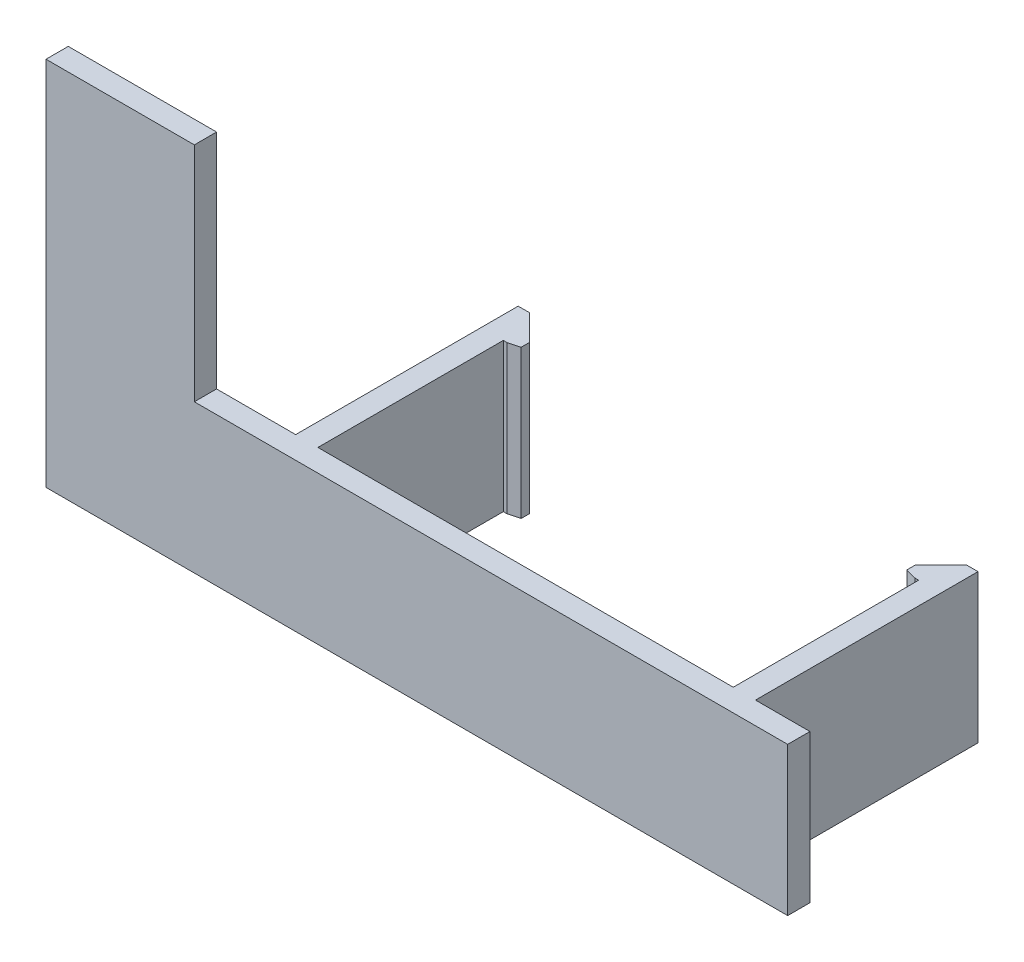
ISO-10303-21;
HEADER;
FILE_DESCRIPTION(('STEP AP214'),'2;1');
FILE_NAME('part.step','',(''),(''),'','','');
FILE_SCHEMA(('AUTOMOTIVE_DESIGN { 1 0 10303 214 1 1 1 1 }'));
ENDSEC;
DATA;
#1=APPLICATION_CONTEXT('core data for automotive mechanical design processes');
#2=APPLICATION_PROTOCOL_DEFINITION('international standard','automotive_design',2000,#1);
#3=PRODUCT_CONTEXT('',#1,'mechanical');
#4=PRODUCT('Part','Part','',(#3));
#5=PRODUCT_RELATED_PRODUCT_CATEGORY('part','',(#4));
#6=PRODUCT_DEFINITION_FORMATION('','',#4);
#7=PRODUCT_DEFINITION_CONTEXT('part definition',#1,'design');
#8=PRODUCT_DEFINITION('design','',#6,#7);
#9=PRODUCT_DEFINITION_SHAPE('','',#8);
#10=(LENGTH_UNIT() NAMED_UNIT(*) SI_UNIT(.MILLI.,.METRE.));
#11=(NAMED_UNIT(*) PLANE_ANGLE_UNIT() SI_UNIT($,.RADIAN.));
#12=(NAMED_UNIT(*) SI_UNIT($,.STERADIAN.) SOLID_ANGLE_UNIT());
#13=UNCERTAINTY_MEASURE_WITH_UNIT(LENGTH_MEASURE(1.E-05),#10,'distance_accuracy_value','');
#14=(GEOMETRIC_REPRESENTATION_CONTEXT(3) GLOBAL_UNCERTAINTY_ASSIGNED_CONTEXT((#13)) GLOBAL_UNIT_ASSIGNED_CONTEXT((#10,
#11,#12)) REPRESENTATION_CONTEXT('',''));
#15=CARTESIAN_POINT('',(0.,0.,0.));
#16=DIRECTION('',(0.,0.,1.));
#17=DIRECTION('',(1.,0.,0.));
#18=AXIS2_PLACEMENT_3D('',#15,#16,#17);
#19=CARTESIAN_POINT('',(0.,0.,0.));
#20=DIRECTION('',(0.,0.,1.));
#21=DIRECTION('',(1.,0.,0.));
#22=AXIS2_PLACEMENT_3D('',#19,#20,#21);
#23=PLANE('',#22);
#24=DIRECTION('',(-1.,0.,0.));
#25=VECTOR('',#24,1.);
#26=CARTESIAN_POINT('',(0.,-30.,0.));
#27=LINE('',#26,#25);
#28=CARTESIAN_POINT('',(-19.3380528872022,-30.,0.));
#29=VERTEX_POINT('',#28);
#30=CARTESIAN_POINT('',(-29.9999999999999,-30.,0.));
#31=VERTEX_POINT('',#30);
#32=EDGE_CURVE('E331',#29,#31,#27,.T.);
#33=ORIENTED_EDGE('',*,*,#32,.F.);
#34=DIRECTION('',(0.,-1.,0.));
#35=VECTOR('',#34,1.);
#36=CARTESIAN_POINT('',(-19.3380528872022,-50.,0.));
#37=LINE('',#36,#35);
#38=CARTESIAN_POINT('',(-19.3380528872022,-50.,0.));
#39=VERTEX_POINT('',#38);
#40=EDGE_CURVE('E212',#29,#39,#37,.T.);
#41=ORIENTED_EDGE('',*,*,#40,.T.);
#42=DIRECTION('',(1.,0.,0.));
#43=VECTOR('',#42,1.);
#44=CARTESIAN_POINT('',(0.,-50.,0.));
#45=LINE('',#44,#43);
#46=CARTESIAN_POINT('',(-50.,-50.,0.));
#47=VERTEX_POINT('',#46);
#48=EDGE_CURVE('E323',#47,#39,#45,.T.);
#49=ORIENTED_EDGE('',*,*,#48,.F.);
#50=DIRECTION('',(0.,1.,0.));
#51=VECTOR('',#50,1.);
#52=CARTESIAN_POINT('',(-50.,0.,0.));
#53=LINE('',#52,#51);
#54=CARTESIAN_POINT('',(-50.,0.,0.));
#55=VERTEX_POINT('',#54);
#56=EDGE_CURVE('E318',#47,#55,#53,.T.);
#57=ORIENTED_EDGE('',*,*,#56,.T.);
#58=DIRECTION('',(1.,0.,0.));
#59=VECTOR('',#58,1.);
#60=CARTESIAN_POINT('',(0.,0.,0.));
#61=LINE('',#60,#59);
#62=CARTESIAN_POINT('',(-30.,0.,0.));
#63=VERTEX_POINT('',#62);
#64=EDGE_CURVE('E291',#55,#63,#61,.T.);
#65=ORIENTED_EDGE('',*,*,#64,.T.);
#66=DIRECTION('',(0.,-1.,0.));
#67=VECTOR('',#66,1.);
#68=CARTESIAN_POINT('',(-30.,0.,0.));
#69=LINE('',#68,#67);
#70=EDGE_CURVE('E297',#63,#31,#69,.T.);
#71=ORIENTED_EDGE('',*,*,#70,.T.);
#72=EDGE_LOOP('',(#33,#41,#49,#57,#65,#71));
#73=FACE_BOUND('',#72,.T.);
#74=ADVANCED_FACE('F43',(#73),#23,.F.);
#75=CARTESIAN_POINT('',(39.6619471127978,-50.,-30.));
#76=DIRECTION('',(1.,0.,0.));
#77=DIRECTION('',(0.,0.,-1.));
#78=AXIS2_PLACEMENT_3D('',#75,#76,#77);
#79=PLANE('',#78);
#80=DIRECTION('',(0.,1.,0.));
#81=VECTOR('',#80,1.);
#82=CARTESIAN_POINT('',(39.6619471127978,-50.,-25.));
#83=LINE('',#82,#81);
#84=CARTESIAN_POINT('',(39.6619471127978,-50.,-25.));
#85=VERTEX_POINT('',#84);
#86=CARTESIAN_POINT('',(39.6619471127978,-30.,-25.));
#87=VERTEX_POINT('',#86);
#88=EDGE_CURVE('E214',#85,#87,#83,.T.);
#89=ORIENTED_EDGE('',*,*,#88,.F.);
#90=DIRECTION('',(0.,0.,1.));
#91=VECTOR('',#90,1.);
#92=CARTESIAN_POINT('',(39.6619471127978,-50.,-30.));
#93=LINE('',#92,#91);
#94=CARTESIAN_POINT('',(39.6619471127978,-50.,0.));
#95=VERTEX_POINT('',#94);
#96=EDGE_CURVE('E283',#85,#95,#93,.T.);
#97=ORIENTED_EDGE('',*,*,#96,.T.);
#98=DIRECTION('',(0.,1.,0.));
#99=VECTOR('',#98,1.);
#100=CARTESIAN_POINT('',(39.6619471127978,-50.,0.));
#101=LINE('',#100,#99);
#102=CARTESIAN_POINT('',(39.6619471127978,-30.,0.));
#103=VERTEX_POINT('',#102);
#104=EDGE_CURVE('E263',#95,#103,#101,.T.);
#105=ORIENTED_EDGE('',*,*,#104,.T.);
#106=DIRECTION('',(0.,0.,1.));
#107=VECTOR('',#106,1.);
#108=CARTESIAN_POINT('',(39.6619471127978,-30.,-30.));
#109=LINE('',#108,#107);
#110=EDGE_CURVE('E280',#87,#103,#109,.T.);
#111=ORIENTED_EDGE('',*,*,#110,.F.);
#112=EDGE_LOOP('',(#89,#97,#105,#111));
#113=FACE_BOUND('',#112,.T.);
#114=ADVANCED_FACE('F453',(#113),#79,.F.);
#115=DIRECTION('',(0.,-1.,0.));
#116=VECTOR('',#115,1.);
#117=CARTESIAN_POINT('',(42.6619471127978,-50.,0.));
#118=LINE('',#117,#116);
#119=CARTESIAN_POINT('',(42.6619471127978,-30.,0.));
#120=VERTEX_POINT('',#119);
#121=CARTESIAN_POINT('',(42.6619471127978,-50.,0.));
#122=VERTEX_POINT('',#121);
#123=EDGE_CURVE('E257',#120,#122,#118,.T.);
#124=ORIENTED_EDGE('',*,*,#123,.F.);
#125=CARTESIAN_POINT('',(50.,-30.,0.));
#126=VERTEX_POINT('',#125);
#127=EDGE_CURVE('E332',#126,#120,#27,.T.);
#128=ORIENTED_EDGE('',*,*,#127,.F.);
#129=DIRECTION('',(0.,1.,0.));
#130=VECTOR('',#129,1.);
#131=CARTESIAN_POINT('',(50.,0.,0.));
#132=LINE('',#131,#130);
#133=CARTESIAN_POINT('',(50.,-50.,0.));
#134=VERTEX_POINT('',#133);
#135=EDGE_CURVE('E327',#134,#126,#132,.T.);
#136=ORIENTED_EDGE('',*,*,#135,.F.);
#137=EDGE_CURVE('E322',#122,#134,#45,.T.);
#138=ORIENTED_EDGE('',*,*,#137,.F.);
#139=EDGE_LOOP('',(#124,#128,#136,#138));
#140=FACE_BOUND('',#139,.T.);
#141=ADVANCED_FACE('F422',(#140),#23,.F.);
#142=CARTESIAN_POINT('',(-16.3380528872022,-50.,0.));
#143=VERTEX_POINT('',#142);
#144=EDGE_CURVE('E328',#143,#95,#45,.T.);
#145=ORIENTED_EDGE('',*,*,#144,.F.);
#146=DIRECTION('',(0.,1.,0.));
#147=VECTOR('',#146,1.);
#148=CARTESIAN_POINT('',(-16.3380528872022,-50.,0.));
#149=LINE('',#148,#147);
#150=CARTESIAN_POINT('',(-16.3380528872022,-30.,0.));
#151=VERTEX_POINT('',#150);
#152=EDGE_CURVE('E220',#143,#151,#149,.T.);
#153=ORIENTED_EDGE('',*,*,#152,.T.);
#154=EDGE_CURVE('E336',#103,#151,#27,.T.);
#155=ORIENTED_EDGE('',*,*,#154,.F.);
#156=ORIENTED_EDGE('',*,*,#104,.F.);
#157=EDGE_LOOP('',(#145,#153,#155,#156));
#158=FACE_BOUND('',#157,.T.);
#159=ADVANCED_FACE('F459',(#158),#23,.F.);
#160=CARTESIAN_POINT('',(0.,0.,3.));
#161=DIRECTION('',(0.,1.,0.));
#162=DIRECTION('',(0.,0.,1.));
#163=AXIS2_PLACEMENT_3D('',#160,#161,#162);
#164=PLANE('',#163);
#165=ORIENTED_EDGE('',*,*,#64,.F.);
#166=DIRECTION('',(0.,0.,-1.));
#167=VECTOR('',#166,1.);
#168=CARTESIAN_POINT('',(-50.,0.,3.));
#169=LINE('',#168,#167);
#170=CARTESIAN_POINT('',(-50.,0.,3.));
#171=VERTEX_POINT('',#170);
#172=EDGE_CURVE('E357',#171,#55,#169,.T.);
#173=ORIENTED_EDGE('',*,*,#172,.F.);
#174=DIRECTION('',(1.,0.,0.));
#175=VECTOR('',#174,1.);
#176=CARTESIAN_POINT('',(0.,0.,3.));
#177=LINE('',#176,#175);
#178=CARTESIAN_POINT('',(-30.,0.,3.));
#179=VERTEX_POINT('',#178);
#180=EDGE_CURVE('E292',#171,#179,#177,.T.);
#181=ORIENTED_EDGE('',*,*,#180,.T.);
#182=DIRECTION('',(0.,0.,-1.));
#183=VECTOR('',#182,1.);
#184=CARTESIAN_POINT('',(-30.,0.,3.));
#185=LINE('',#184,#183);
#186=EDGE_CURVE('E314',#179,#63,#185,.T.);
#187=ORIENTED_EDGE('',*,*,#186,.T.);
#188=EDGE_LOOP('',(#165,#173,#181,#187));
#189=FACE_BOUND('',#188,.T.);
#190=ADVANCED_FACE('F500',(#189),#164,.T.);
#191=CARTESIAN_POINT('',(-50.,0.,3.));
#192=DIRECTION('',(-1.,0.,0.));
#193=DIRECTION('',(0.,0.,1.));
#194=AXIS2_PLACEMENT_3D('',#191,#192,#193);
#195=PLANE('',#194);
#196=ORIENTED_EDGE('',*,*,#56,.F.);
#197=DIRECTION('',(0.,0.,-1.));
#198=VECTOR('',#197,1.);
#199=CARTESIAN_POINT('',(-50.,-50.,3.));
#200=LINE('',#199,#198);
#201=CARTESIAN_POINT('',(-50.,-50.,3.));
#202=VERTEX_POINT('',#201);
#203=EDGE_CURVE('E354',#202,#47,#200,.T.);
#204=ORIENTED_EDGE('',*,*,#203,.F.);
#205=DIRECTION('',(0.,1.,0.));
#206=VECTOR('',#205,1.);
#207=CARTESIAN_POINT('',(-50.,0.,3.));
#208=LINE('',#207,#206);
#209=EDGE_CURVE('E296',#202,#171,#208,.T.);
#210=ORIENTED_EDGE('',*,*,#209,.T.);
#211=ORIENTED_EDGE('',*,*,#172,.T.);
#212=EDGE_LOOP('',(#196,#204,#210,#211));
#213=FACE_BOUND('',#212,.T.);
#214=ADVANCED_FACE('F497',(#213),#195,.T.);
#215=CARTESIAN_POINT('',(0.,-50.,3.));
#216=DIRECTION('',(0.,1.,0.));
#217=DIRECTION('',(0.,0.,1.));
#218=AXIS2_PLACEMENT_3D('',#215,#216,#217);
#219=PLANE('',#218);
#220=DIRECTION('',(0.,0.,1.));
#221=VECTOR('',#220,1.);
#222=CARTESIAN_POINT('',(-14.3380528872022,-50.,-30.));
#223=LINE('',#222,#221);
#224=CARTESIAN_POINT('',(-14.3380528872022,-50.,-26.5));
#225=VERTEX_POINT('',#224);
#226=CARTESIAN_POINT('',(-14.3380528872022,-50.,-25.4019237886467));
#227=VERTEX_POINT('',#226);
#228=EDGE_CURVE('E471',#225,#227,#223,.T.);
#229=ORIENTED_EDGE('',*,*,#228,.T.);
#230=DIRECTION('',(-0.965925826289069,0.,0.258819045102519));
#231=VECTOR('',#230,1.);
#232=CARTESIAN_POINT('',(-15.8380528872022,-50.,-25.));
#233=LINE('',#232,#231);
#234=CARTESIAN_POINT('',(-15.8380528872022,-50.,-25.));
#235=VERTEX_POINT('',#234);
#236=EDGE_CURVE('E11',#227,#235,#233,.T.);
#237=ORIENTED_EDGE('',*,*,#236,.T.);
#238=DIRECTION('',(-1.,0.,0.));
#239=VECTOR('',#238,1.);
#240=CARTESIAN_POINT('',(-14.3380528872022,-50.,-25.));
#241=LINE('',#240,#239);
#242=CARTESIAN_POINT('',(-16.3380528872022,-50.,-25.));
#243=VERTEX_POINT('',#242);
#244=EDGE_CURVE('E469',#235,#243,#241,.T.);
#245=ORIENTED_EDGE('',*,*,#244,.T.);
#246=DIRECTION('',(0.,0.,1.));
#247=VECTOR('',#246,1.);
#248=CARTESIAN_POINT('',(-16.3380528872022,-50.,-30.));
#249=LINE('',#248,#247);
#250=EDGE_CURVE('E236',#243,#143,#249,.T.);
#251=ORIENTED_EDGE('',*,*,#250,.T.);
#252=ORIENTED_EDGE('',*,*,#144,.T.);
#253=ORIENTED_EDGE('',*,*,#96,.F.);
#254=DIRECTION('',(1.,0.,0.));
#255=VECTOR('',#254,1.);
#256=CARTESIAN_POINT('',(37.6619471127978,-50.,-25.));
#257=LINE('',#256,#255);
#258=CARTESIAN_POINT('',(39.1619471127978,-50.,-25.));
#259=VERTEX_POINT('',#258);
#260=EDGE_CURVE('E254',#259,#85,#257,.T.);
#261=ORIENTED_EDGE('',*,*,#260,.F.);
#262=DIRECTION('',(0.965925826289069,0.,0.258819045102519));
#263=VECTOR('',#262,1.);
#264=CARTESIAN_POINT('',(37.6619471127978,-50.,-25.4019237886467));
#265=LINE('',#264,#263);
#266=CARTESIAN_POINT('',(37.6619471127978,-50.,-25.4019237886467));
#267=VERTEX_POINT('',#266);
#268=EDGE_CURVE('E384',#259,#267,#265,.F.);
#269=ORIENTED_EDGE('',*,*,#268,.T.);
#270=DIRECTION('',(0.,0.,1.));
#271=VECTOR('',#270,1.);
#272=CARTESIAN_POINT('',(37.6619471127978,-50.,-30.));
#273=LINE('',#272,#271);
#274=CARTESIAN_POINT('',(37.6619471127978,-50.,-26.5));
#275=VERTEX_POINT('',#274);
#276=EDGE_CURVE('E241',#275,#267,#273,.T.);
#277=ORIENTED_EDGE('',*,*,#276,.F.);
#278=DIRECTION('',(-0.707106781186549,0.,0.707106781186546));
#279=VECTOR('',#278,1.);
#280=CARTESIAN_POINT('',(37.6619471127978,-50.,-26.5));
#281=LINE('',#280,#279);
#282=CARTESIAN_POINT('',(41.1619471127978,-50.,-30.));
#283=VERTEX_POINT('',#282);
#284=EDGE_CURVE('E364',#275,#283,#281,.F.);
#285=ORIENTED_EDGE('',*,*,#284,.T.);
#286=DIRECTION('',(-1.,0.,0.));
#287=VECTOR('',#286,1.);
#288=CARTESIAN_POINT('',(42.6619471127978,-50.,-30.));
#289=LINE('',#288,#287);
#290=CARTESIAN_POINT('',(42.6619471127978,-50.,-30.));
#291=VERTEX_POINT('',#290);
#292=EDGE_CURVE('E262',#291,#283,#289,.T.);
#293=ORIENTED_EDGE('',*,*,#292,.F.);
#294=DIRECTION('',(0.,0.,1.));
#295=VECTOR('',#294,1.);
#296=CARTESIAN_POINT('',(42.6619471127978,-50.,-30.));
#297=LINE('',#296,#295);
#298=EDGE_CURVE('E287',#291,#122,#297,.T.);
#299=ORIENTED_EDGE('',*,*,#298,.T.);
#300=ORIENTED_EDGE('',*,*,#137,.T.);
#301=DIRECTION('',(0.,0.,-1.));
#302=VECTOR('',#301,1.);
#303=CARTESIAN_POINT('',(50.,-50.,3.));
#304=LINE('',#303,#302);
#305=CARTESIAN_POINT('',(50.,-50.,3.));
#306=VERTEX_POINT('',#305);
#307=EDGE_CURVE('E350',#306,#134,#304,.T.);
#308=ORIENTED_EDGE('',*,*,#307,.F.);
#309=DIRECTION('',(1.,0.,0.));
#310=VECTOR('',#309,1.);
#311=CARTESIAN_POINT('',(0.,-50.,3.));
#312=LINE('',#311,#310);
#313=EDGE_CURVE('E301',#202,#306,#312,.T.);
#314=ORIENTED_EDGE('',*,*,#313,.F.);
#315=ORIENTED_EDGE('',*,*,#203,.T.);
#316=ORIENTED_EDGE('',*,*,#48,.T.);
#317=DIRECTION('',(0.,0.,1.));
#318=VECTOR('',#317,1.);
#319=CARTESIAN_POINT('',(-19.3380528872022,-50.,-30.));
#320=LINE('',#319,#318);
#321=CARTESIAN_POINT('',(-19.3380528872022,-50.,-30.));
#322=VERTEX_POINT('',#321);
#323=EDGE_CURVE('E231',#322,#39,#320,.T.);
#324=ORIENTED_EDGE('',*,*,#323,.F.);
#325=DIRECTION('',(1.,0.,0.));
#326=VECTOR('',#325,1.);
#327=CARTESIAN_POINT('',(-19.3380528872022,-50.,-30.));
#328=LINE('',#327,#326);
#329=CARTESIAN_POINT('',(-17.8380528872022,-50.,-30.));
#330=VERTEX_POINT('',#329);
#331=EDGE_CURVE('E204',#322,#330,#328,.T.);
#332=ORIENTED_EDGE('',*,*,#331,.T.);
#333=DIRECTION('',(-0.707106781186549,0.,-0.707106781186546));
#334=VECTOR('',#333,1.);
#335=CARTESIAN_POINT('',(-17.8380528872022,-50.,-30.));
#336=LINE('',#335,#334);
#337=EDGE_CURVE('E390',#330,#225,#336,.F.);
#338=ORIENTED_EDGE('',*,*,#337,.T.);
#339=EDGE_LOOP('',(#229,#237,#245,#251,#252,#253,#261,#269,#277,#285,#293,#299,#300,#308,#314,
#315,#316,#324,#332,#338));
#340=FACE_BOUND('',#339,.T.);
#341=ADVANCED_FACE('F412',(#340),#219,.F.);
#342=CARTESIAN_POINT('',(50.,0.,3.));
#343=DIRECTION('',(-1.,0.,0.));
#344=DIRECTION('',(0.,0.,1.));
#345=AXIS2_PLACEMENT_3D('',#342,#343,#344);
#346=PLANE('',#345);
#347=ORIENTED_EDGE('',*,*,#135,.T.);
#348=DIRECTION('',(0.,0.,-1.));
#349=VECTOR('',#348,1.);
#350=CARTESIAN_POINT('',(50.,-30.,3.));
#351=LINE('',#350,#349);
#352=CARTESIAN_POINT('',(50.,-30.,3.));
#353=VERTEX_POINT('',#352);
#354=EDGE_CURVE('E346',#353,#126,#351,.T.);
#355=ORIENTED_EDGE('',*,*,#354,.F.);
#356=DIRECTION('',(0.,1.,0.));
#357=VECTOR('',#356,1.);
#358=CARTESIAN_POINT('',(50.,0.,3.));
#359=LINE('',#358,#357);
#360=EDGE_CURVE('E304',#306,#353,#359,.T.);
#361=ORIENTED_EDGE('',*,*,#360,.F.);
#362=ORIENTED_EDGE('',*,*,#307,.T.);
#363=EDGE_LOOP('',(#347,#355,#361,#362));
#364=FACE_BOUND('',#363,.T.);
#365=ADVANCED_FACE('F419',(#364),#346,.F.);
#366=CARTESIAN_POINT('',(0.,-30.,3.));
#367=DIRECTION('',(0.,-1.,0.));
#368=DIRECTION('',(1.,0.,0.));
#369=AXIS2_PLACEMENT_3D('',#366,#367,#368);
#370=PLANE('',#369);
#371=DIRECTION('',(-1.,0.,0.));
#372=VECTOR('',#371,1.);
#373=CARTESIAN_POINT('',(-14.3380528872022,-30.,-25.));
#374=LINE('',#373,#372);
#375=CARTESIAN_POINT('',(-15.8380528872022,-30.,-25.));
#376=VERTEX_POINT('',#375);
#377=CARTESIAN_POINT('',(-16.3380528872022,-30.,-25.));
#378=VERTEX_POINT('',#377);
#379=EDGE_CURVE('E226',#376,#378,#374,.T.);
#380=ORIENTED_EDGE('',*,*,#379,.F.);
#381=DIRECTION('',(0.965925826289069,0.,-0.258819045102519));
#382=VECTOR('',#381,1.);
#383=CARTESIAN_POINT('',(-15.8380528872022,-30.,-25.));
#384=LINE('',#383,#382);
#385=CARTESIAN_POINT('',(-14.3380528872022,-30.,-25.4019237886467));
#386=VERTEX_POINT('',#385);
#387=EDGE_CURVE('E67',#376,#386,#384,.T.);
#388=ORIENTED_EDGE('',*,*,#387,.T.);
#389=DIRECTION('',(0.,0.,-1.));
#390=VECTOR('',#389,1.);
#391=CARTESIAN_POINT('',(-14.3380528872022,-30.,-30.));
#392=LINE('',#391,#390);
#393=CARTESIAN_POINT('',(-14.3380528872022,-30.,-26.5));
#394=VERTEX_POINT('',#393);
#395=EDGE_CURVE('E474',#386,#394,#392,.T.);
#396=ORIENTED_EDGE('',*,*,#395,.T.);
#397=DIRECTION('',(0.707106781186549,0.,0.707106781186546));
#398=VECTOR('',#397,1.);
#399=CARTESIAN_POINT('',(-17.8380528872022,-30.,-30.));
#400=LINE('',#399,#398);
#401=CARTESIAN_POINT('',(-17.8380528872022,-30.,-30.));
#402=VERTEX_POINT('',#401);
#403=EDGE_CURVE('E198',#394,#402,#400,.F.);
#404=ORIENTED_EDGE('',*,*,#403,.T.);
#405=DIRECTION('',(-1.,0.,0.));
#406=VECTOR('',#405,1.);
#407=CARTESIAN_POINT('',(-19.3380528872022,-30.,-30.));
#408=LINE('',#407,#406);
#409=CARTESIAN_POINT('',(-19.3380528872022,-30.,-30.));
#410=VERTEX_POINT('',#409);
#411=EDGE_CURVE('E192',#402,#410,#408,.T.);
#412=ORIENTED_EDGE('',*,*,#411,.T.);
#413=DIRECTION('',(0.,0.,1.));
#414=VECTOR('',#413,1.);
#415=CARTESIAN_POINT('',(-19.3380528872022,-30.,-30.));
#416=LINE('',#415,#414);
#417=EDGE_CURVE('E195',#410,#29,#416,.T.);
#418=ORIENTED_EDGE('',*,*,#417,.T.);
#419=ORIENTED_EDGE('',*,*,#32,.T.);
#420=DIRECTION('',(0.,0.,-1.));
#421=VECTOR('',#420,1.);
#422=CARTESIAN_POINT('',(-29.9999999999999,-30.,3.));
#423=LINE('',#422,#421);
#424=CARTESIAN_POINT('',(-29.9999999999999,-30.,3.));
#425=VERTEX_POINT('',#424);
#426=EDGE_CURVE('E342',#425,#31,#423,.T.);
#427=ORIENTED_EDGE('',*,*,#426,.F.);
#428=DIRECTION('',(-1.,0.,0.));
#429=VECTOR('',#428,1.);
#430=CARTESIAN_POINT('',(0.,-30.,3.));
#431=LINE('',#430,#429);
#432=EDGE_CURVE('E307',#353,#425,#431,.T.);
#433=ORIENTED_EDGE('',*,*,#432,.F.);
#434=ORIENTED_EDGE('',*,*,#354,.T.);
#435=ORIENTED_EDGE('',*,*,#127,.T.);
#436=DIRECTION('',(0.,0.,1.));
#437=VECTOR('',#436,1.);
#438=CARTESIAN_POINT('',(42.6619471127978,-30.,-30.));
#439=LINE('',#438,#437);
#440=CARTESIAN_POINT('',(42.6619471127978,-30.,-30.));
#441=VERTEX_POINT('',#440);
#442=EDGE_CURVE('E270',#441,#120,#439,.T.);
#443=ORIENTED_EDGE('',*,*,#442,.F.);
#444=DIRECTION('',(1.,0.,0.));
#445=VECTOR('',#444,1.);
#446=CARTESIAN_POINT('',(42.6619471127978,-30.,-30.));
#447=LINE('',#446,#445);
#448=CARTESIAN_POINT('',(41.1619471127978,-30.,-30.));
#449=VERTEX_POINT('',#448);
#450=EDGE_CURVE('E267',#449,#441,#447,.T.);
#451=ORIENTED_EDGE('',*,*,#450,.F.);
#452=DIRECTION('',(0.707106781186549,0.,-0.707106781186546));
#453=VECTOR('',#452,1.);
#454=CARTESIAN_POINT('',(37.6619471127978,-30.,-26.5));
#455=LINE('',#454,#453);
#456=CARTESIAN_POINT('',(37.6619471127978,-30.,-26.5));
#457=VERTEX_POINT('',#456);
#458=EDGE_CURVE('E370',#449,#457,#455,.F.);
#459=ORIENTED_EDGE('',*,*,#458,.T.);
#460=DIRECTION('',(0.,0.,-1.));
#461=VECTOR('',#460,1.);
#462=CARTESIAN_POINT('',(37.6619471127978,-30.,-30.));
#463=LINE('',#462,#461);
#464=CARTESIAN_POINT('',(37.6619471127978,-30.,-25.4019237886467));
#465=VERTEX_POINT('',#464);
#466=EDGE_CURVE('E245',#465,#457,#463,.T.);
#467=ORIENTED_EDGE('',*,*,#466,.F.);
#468=DIRECTION('',(-0.965925826289069,0.,-0.258819045102519));
#469=VECTOR('',#468,1.);
#470=CARTESIAN_POINT('',(37.6619471127978,-30.,-25.4019237886467));
#471=LINE('',#470,#469);
#472=CARTESIAN_POINT('',(39.1619471127978,-30.,-25.));
#473=VERTEX_POINT('',#472);
#474=EDGE_CURVE('E378',#465,#473,#471,.F.);
#475=ORIENTED_EDGE('',*,*,#474,.T.);
#476=DIRECTION('',(1.,0.,0.));
#477=VECTOR('',#476,1.);
#478=CARTESIAN_POINT('',(37.6619471127978,-30.,-25.));
#479=LINE('',#478,#477);
#480=EDGE_CURVE('E248',#473,#87,#479,.T.);
#481=ORIENTED_EDGE('',*,*,#480,.T.);
#482=ORIENTED_EDGE('',*,*,#110,.T.);
#483=ORIENTED_EDGE('',*,*,#154,.T.);
#484=DIRECTION('',(0.,0.,1.));
#485=VECTOR('',#484,1.);
#486=CARTESIAN_POINT('',(-16.3380528872022,-30.,-30.));
#487=LINE('',#486,#485);
#488=EDGE_CURVE('E215',#378,#151,#487,.T.);
#489=ORIENTED_EDGE('',*,*,#488,.F.);
#490=EDGE_LOOP('',(#380,#388,#396,#404,#412,#418,#419,#427,#433,#434,#435,#443,#451,#459,#467,
#475,#481,#482,#483,#489));
#491=FACE_BOUND('',#490,.T.);
#492=ADVANCED_FACE('F194',(#491),#370,.F.);
#493=CARTESIAN_POINT('',(-30.,0.,3.));
#494=DIRECTION('',(1.,0.,0.));
#495=DIRECTION('',(0.,1.,0.));
#496=AXIS2_PLACEMENT_3D('',#493,#494,#495);
#497=PLANE('',#496);
#498=ORIENTED_EDGE('',*,*,#70,.F.);
#499=ORIENTED_EDGE('',*,*,#186,.F.);
#500=DIRECTION('',(0.,-1.,0.));
#501=VECTOR('',#500,1.);
#502=CARTESIAN_POINT('',(-30.,0.,3.));
#503=LINE('',#502,#501);
#504=EDGE_CURVE('E310',#179,#425,#503,.T.);
#505=ORIENTED_EDGE('',*,*,#504,.T.);
#506=ORIENTED_EDGE('',*,*,#426,.T.);
#507=EDGE_LOOP('',(#498,#499,#505,#506));
#508=FACE_BOUND('',#507,.T.);
#509=ADVANCED_FACE('F490',(#508),#497,.T.);
#510=CARTESIAN_POINT('',(0.,0.,3.));
#511=DIRECTION('',(0.,0.,1.));
#512=DIRECTION('',(1.,0.,0.));
#513=AXIS2_PLACEMENT_3D('',#510,#511,#512);
#514=PLANE('',#513);
#515=ORIENTED_EDGE('',*,*,#180,.F.);
#516=ORIENTED_EDGE('',*,*,#209,.F.);
#517=ORIENTED_EDGE('',*,*,#313,.T.);
#518=ORIENTED_EDGE('',*,*,#360,.T.);
#519=ORIENTED_EDGE('',*,*,#432,.T.);
#520=ORIENTED_EDGE('',*,*,#504,.F.);
#521=EDGE_LOOP('',(#515,#516,#517,#518,#519,#520));
#522=FACE_BOUND('',#521,.T.);
#523=ADVANCED_FACE('F494',(#522),#514,.T.);
#524=CARTESIAN_POINT('',(42.6619471127978,-50.,-30.));
#525=DIRECTION('',(-1.,0.,0.));
#526=DIRECTION('',(0.,0.,1.));
#527=AXIS2_PLACEMENT_3D('',#524,#525,#526);
#528=PLANE('',#527);
#529=ORIENTED_EDGE('',*,*,#123,.T.);
#530=ORIENTED_EDGE('',*,*,#298,.F.);
#531=DIRECTION('',(0.,-1.,0.));
#532=VECTOR('',#531,1.);
#533=CARTESIAN_POINT('',(42.6619471127978,-50.,-30.));
#534=LINE('',#533,#532);
#535=EDGE_CURVE('E258',#441,#291,#534,.T.);
#536=ORIENTED_EDGE('',*,*,#535,.F.);
#537=ORIENTED_EDGE('',*,*,#442,.T.);
#538=EDGE_LOOP('',(#529,#530,#536,#537));
#539=FACE_BOUND('',#538,.T.);
#540=ADVANCED_FACE('F428',(#539),#528,.F.);
#541=CARTESIAN_POINT('',(0.,0.,-30.));
#542=DIRECTION('',(0.,0.,1.));
#543=DIRECTION('',(1.,0.,0.));
#544=AXIS2_PLACEMENT_3D('',#541,#542,#543);
#545=PLANE('',#544);
#546=ORIENTED_EDGE('',*,*,#292,.T.);
#547=DIRECTION('',(0.,1.,0.));
#548=VECTOR('',#547,1.);
#549=CARTESIAN_POINT('',(41.1619471127978,0.,-30.));
#550=LINE('',#549,#548);
#551=EDGE_CURVE('E367',#283,#449,#550,.T.);
#552=ORIENTED_EDGE('',*,*,#551,.T.);
#553=ORIENTED_EDGE('',*,*,#450,.T.);
#554=ORIENTED_EDGE('',*,*,#535,.T.);
#555=EDGE_LOOP('',(#546,#552,#553,#554));
#556=FACE_BOUND('',#555,.T.);
#557=ADVANCED_FACE('F430',(#556),#545,.F.);
#558=CARTESIAN_POINT('',(37.6619471127978,-50.,-25.));
#559=DIRECTION('',(0.,0.,-1.));
#560=DIRECTION('',(-1.,0.,0.));
#561=AXIS2_PLACEMENT_3D('',#558,#559,#560);
#562=PLANE('',#561);
#563=ORIENTED_EDGE('',*,*,#480,.F.);
#564=DIRECTION('',(0.,-1.,0.));
#565=VECTOR('',#564,1.);
#566=CARTESIAN_POINT('',(39.1619471127978,-50.,-25.));
#567=LINE('',#566,#565);
#568=EDGE_CURVE('E381',#473,#259,#567,.T.);
#569=ORIENTED_EDGE('',*,*,#568,.T.);
#570=ORIENTED_EDGE('',*,*,#260,.T.);
#571=ORIENTED_EDGE('',*,*,#88,.T.);
#572=EDGE_LOOP('',(#563,#569,#570,#571));
#573=FACE_BOUND('',#572,.T.);
#574=ADVANCED_FACE('F449',(#573),#562,.F.);
#575=CARTESIAN_POINT('',(37.6619471127978,0.,0.));
#576=DIRECTION('',(1.,0.,0.));
#577=DIRECTION('',(0.,0.,-1.));
#578=AXIS2_PLACEMENT_3D('',#575,#576,#577);
#579=PLANE('',#578);
#580=ORIENTED_EDGE('',*,*,#276,.T.);
#581=DIRECTION('',(0.,1.,0.));
#582=VECTOR('',#581,1.);
#583=CARTESIAN_POINT('',(37.6619471127978,0.,-25.4019237886467));
#584=LINE('',#583,#582);
#585=EDGE_CURVE('E374',#267,#465,#584,.T.);
#586=ORIENTED_EDGE('',*,*,#585,.T.);
#587=ORIENTED_EDGE('',*,*,#466,.T.);
#588=DIRECTION('',(0.,-1.,0.));
#589=VECTOR('',#588,1.);
#590=CARTESIAN_POINT('',(37.6619471127978,0.,-26.5));
#591=LINE('',#590,#589);
#592=EDGE_CURVE('E360',#457,#275,#591,.T.);
#593=ORIENTED_EDGE('',*,*,#592,.T.);
#594=EDGE_LOOP('',(#580,#586,#587,#593));
#595=FACE_BOUND('',#594,.T.);
#596=ADVANCED_FACE('F439',(#595),#579,.F.);
#597=CARTESIAN_POINT('',(37.6619471127978,0.,-26.5));
#598=DIRECTION('',(0.707106781186546,0.,0.707106781186549));
#599=DIRECTION('',(0.,-1.,0.));
#600=AXIS2_PLACEMENT_3D('',#597,#598,#599);
#601=PLANE('',#600);
#602=ORIENTED_EDGE('',*,*,#458,.F.);
#603=ORIENTED_EDGE('',*,*,#551,.F.);
#604=ORIENTED_EDGE('',*,*,#284,.F.);
#605=ORIENTED_EDGE('',*,*,#592,.F.);
#606=EDGE_LOOP('',(#602,#603,#604,#605));
#607=FACE_BOUND('',#606,.T.);
#608=ADVANCED_FACE('F436',(#607),#601,.F.);
#609=CARTESIAN_POINT('',(37.6619471127978,0.,-25.4019237886467));
#610=DIRECTION('',(0.258819045102519,0.,-0.965925826289069));
#611=DIRECTION('',(0.,1.,0.));
#612=AXIS2_PLACEMENT_3D('',#609,#610,#611);
#613=PLANE('',#612);
#614=ORIENTED_EDGE('',*,*,#268,.F.);
#615=ORIENTED_EDGE('',*,*,#568,.F.);
#616=ORIENTED_EDGE('',*,*,#474,.F.);
#617=ORIENTED_EDGE('',*,*,#585,.F.);
#618=EDGE_LOOP('',(#614,#615,#616,#617));
#619=FACE_BOUND('',#618,.T.);
#620=ADVANCED_FACE('F446',(#619),#613,.F.);
#621=CARTESIAN_POINT('',(-19.3380528872022,-50.,-30.));
#622=DIRECTION('',(-1.,0.,0.));
#623=DIRECTION('',(0.,0.,1.));
#624=AXIS2_PLACEMENT_3D('',#621,#622,#623);
#625=PLANE('',#624);
#626=ORIENTED_EDGE('',*,*,#40,.F.);
#627=ORIENTED_EDGE('',*,*,#417,.F.);
#628=DIRECTION('',(0.,-1.,0.));
#629=VECTOR('',#628,1.);
#630=CARTESIAN_POINT('',(-19.3380528872022,-50.,-30.));
#631=LINE('',#630,#629);
#632=EDGE_CURVE('E205',#410,#322,#631,.T.);
#633=ORIENTED_EDGE('',*,*,#632,.T.);
#634=ORIENTED_EDGE('',*,*,#323,.T.);
#635=EDGE_LOOP('',(#626,#627,#633,#634));
#636=FACE_BOUND('',#635,.T.);
#637=ADVANCED_FACE('F209',(#636),#625,.T.);
#638=CARTESIAN_POINT('',(-16.3380528872022,-50.,-30.));
#639=DIRECTION('',(1.,0.,0.));
#640=DIRECTION('',(0.,0.,-1.));
#641=AXIS2_PLACEMENT_3D('',#638,#639,#640);
#642=PLANE('',#641);
#643=DIRECTION('',(0.,1.,0.));
#644=VECTOR('',#643,1.);
#645=CARTESIAN_POINT('',(-16.3380528872022,-50.,-25.));
#646=LINE('',#645,#644);
#647=EDGE_CURVE('E466',#243,#378,#646,.T.);
#648=ORIENTED_EDGE('',*,*,#647,.T.);
#649=ORIENTED_EDGE('',*,*,#488,.T.);
#650=ORIENTED_EDGE('',*,*,#152,.F.);
#651=ORIENTED_EDGE('',*,*,#250,.F.);
#652=EDGE_LOOP('',(#648,#649,#650,#651));
#653=FACE_BOUND('',#652,.T.);
#654=ADVANCED_FACE('F464',(#653),#642,.T.);
#655=CARTESIAN_POINT('',(23.3238942255956,0.,-30.));
#656=DIRECTION('',(0.,0.,1.));
#657=DIRECTION('',(-1.,0.,0.));
#658=AXIS2_PLACEMENT_3D('',#655,#656,#657);
#659=PLANE('',#658);
#660=ORIENTED_EDGE('',*,*,#411,.F.);
#661=DIRECTION('',(0.,-1.,0.));
#662=VECTOR('',#661,1.);
#663=CARTESIAN_POINT('',(-17.8380528872022,0.,-30.));
#664=LINE('',#663,#662);
#665=EDGE_CURVE('E387',#402,#330,#664,.T.);
#666=ORIENTED_EDGE('',*,*,#665,.T.);
#667=ORIENTED_EDGE('',*,*,#331,.F.);
#668=ORIENTED_EDGE('',*,*,#632,.F.);
#669=EDGE_LOOP('',(#660,#666,#667,#668));
#670=FACE_BOUND('',#669,.T.);
#671=ADVANCED_FACE('F217',(#670),#659,.F.);
#672=CARTESIAN_POINT('',(-14.3380528872022,-50.,-25.));
#673=DIRECTION('',(0.,0.,1.));
#674=DIRECTION('',(1.,0.,0.));
#675=AXIS2_PLACEMENT_3D('',#672,#673,#674);
#676=PLANE('',#675);
#677=ORIENTED_EDGE('',*,*,#244,.F.);
#678=DIRECTION('',(0.,1.,0.));
#679=VECTOR('',#678,1.);
#680=CARTESIAN_POINT('',(-15.8380528872022,-30.,-25.));
#681=LINE('',#680,#679);
#682=EDGE_CURVE('E399',#235,#376,#681,.T.);
#683=ORIENTED_EDGE('',*,*,#682,.T.);
#684=ORIENTED_EDGE('',*,*,#379,.T.);
#685=ORIENTED_EDGE('',*,*,#647,.F.);
#686=EDGE_LOOP('',(#677,#683,#684,#685));
#687=FACE_BOUND('',#686,.T.);
#688=ADVANCED_FACE('F579',(#687),#676,.T.);
#689=CARTESIAN_POINT('',(-14.3380528872022,0.,0.));
#690=DIRECTION('',(-1.,0.,0.));
#691=DIRECTION('',(0.,0.,-1.));
#692=AXIS2_PLACEMENT_3D('',#689,#690,#691);
#693=PLANE('',#692);
#694=ORIENTED_EDGE('',*,*,#395,.F.);
#695=DIRECTION('',(0.,-1.,0.));
#696=VECTOR('',#695,1.);
#697=CARTESIAN_POINT('',(-14.3380528872022,-50.,-25.4019237886467));
#698=LINE('',#697,#696);
#699=EDGE_CURVE('E53',#386,#227,#698,.T.);
#700=ORIENTED_EDGE('',*,*,#699,.T.);
#701=ORIENTED_EDGE('',*,*,#228,.F.);
#702=DIRECTION('',(0.,1.,0.));
#703=VECTOR('',#702,1.);
#704=CARTESIAN_POINT('',(-14.3380528872022,0.,-26.5));
#705=LINE('',#704,#703);
#706=EDGE_CURVE('E393',#225,#394,#705,.T.);
#707=ORIENTED_EDGE('',*,*,#706,.T.);
#708=EDGE_LOOP('',(#694,#700,#701,#707));
#709=FACE_BOUND('',#708,.T.);
#710=ADVANCED_FACE('F481',(#709),#693,.F.);
#711=CARTESIAN_POINT('',(-17.8380528872022,0.,-30.));
#712=DIRECTION('',(-0.707106781186546,0.,0.707106781186549));
#713=DIRECTION('',(0.,-1.,0.));
#714=AXIS2_PLACEMENT_3D('',#711,#712,#713);
#715=PLANE('',#714);
#716=ORIENTED_EDGE('',*,*,#403,.F.);
#717=ORIENTED_EDGE('',*,*,#706,.F.);
#718=ORIENTED_EDGE('',*,*,#337,.F.);
#719=ORIENTED_EDGE('',*,*,#665,.F.);
#720=EDGE_LOOP('',(#716,#717,#718,#719));
#721=FACE_BOUND('',#720,.T.);
#722=ADVANCED_FACE('F483',(#721),#715,.F.);
#723=CARTESIAN_POINT('',(-15.8380528872022,-50.,-25.));
#724=DIRECTION('',(0.258819045102519,0.,0.965925826289069));
#725=DIRECTION('',(0.,-1.,0.));
#726=AXIS2_PLACEMENT_3D('',#723,#724,#725);
#727=PLANE('',#726);
#728=ORIENTED_EDGE('',*,*,#236,.F.);
#729=ORIENTED_EDGE('',*,*,#699,.F.);
#730=ORIENTED_EDGE('',*,*,#387,.F.);
#731=ORIENTED_EDGE('',*,*,#682,.F.);
#732=EDGE_LOOP('',(#728,#729,#730,#731));
#733=FACE_BOUND('',#732,.T.);
#734=ADVANCED_FACE('F46',(#733),#727,.T.);
#735=CLOSED_SHELL('',(#74,#114,#141,#159,#190,#214,#341,#365,#492,#509,#523,#540,#557,#574,#596,
#608,#620,#637,#654,#671,#688,#710,#722,#734));
#736=MANIFOLD_SOLID_BREP('B2',#735);
#737=ADVANCED_BREP_SHAPE_REPRESENTATION('',(#18,#736),#14);
#738=SHAPE_DEFINITION_REPRESENTATION(#9,#737);
ENDSEC;
END-ISO-10303-21;
